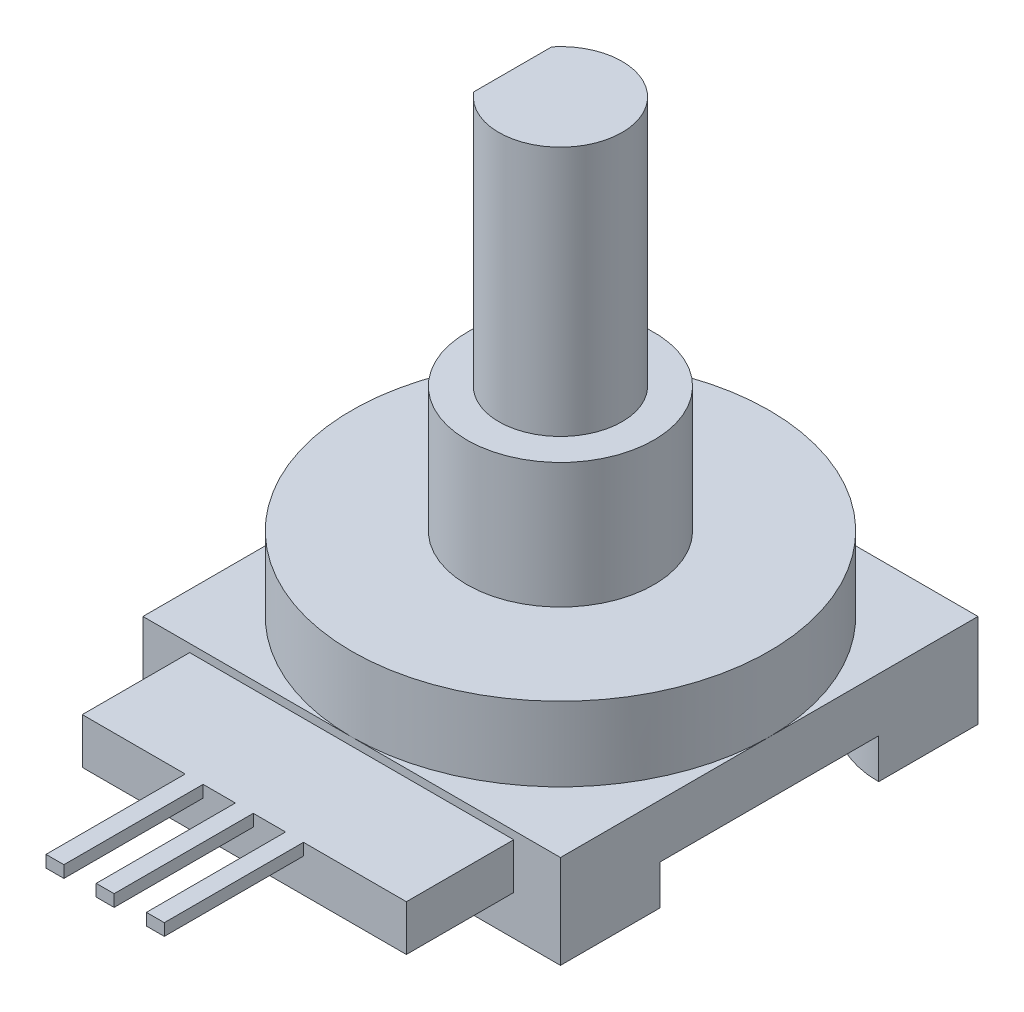
ISO-10303-21;
HEADER;
FILE_DESCRIPTION(('STEP AP214'),'2;1');
FILE_NAME('part.step','',(''),(''),'','','');
FILE_SCHEMA(('AUTOMOTIVE_DESIGN { 1 0 10303 214 1 1 1 1 }'));
ENDSEC;
DATA;
#1=APPLICATION_CONTEXT('core data for automotive mechanical design processes');
#2=APPLICATION_PROTOCOL_DEFINITION('international standard','automotive_design',2000,#1);
#3=PRODUCT_CONTEXT('',#1,'mechanical');
#4=PRODUCT('Part','Part','',(#3));
#5=PRODUCT_RELATED_PRODUCT_CATEGORY('part','',(#4));
#6=PRODUCT_DEFINITION_FORMATION('','',#4);
#7=PRODUCT_DEFINITION_CONTEXT('part definition',#1,'design');
#8=PRODUCT_DEFINITION('design','',#6,#7);
#9=PRODUCT_DEFINITION_SHAPE('','',#8);
#10=(LENGTH_UNIT() NAMED_UNIT(*) SI_UNIT(.MILLI.,.METRE.));
#11=(NAMED_UNIT(*) PLANE_ANGLE_UNIT() SI_UNIT($,.RADIAN.));
#12=(NAMED_UNIT(*) SI_UNIT($,.STERADIAN.) SOLID_ANGLE_UNIT());
#13=UNCERTAINTY_MEASURE_WITH_UNIT(LENGTH_MEASURE(1.E-05),#10,'distance_accuracy_value','');
#14=(GEOMETRIC_REPRESENTATION_CONTEXT(3) GLOBAL_UNCERTAINTY_ASSIGNED_CONTEXT((#13)) GLOBAL_UNIT_ASSIGNED_CONTEXT((#10,
#11,#12)) REPRESENTATION_CONTEXT('',''));
#15=CARTESIAN_POINT('',(0.,0.,0.));
#16=DIRECTION('',(0.,0.,1.));
#17=DIRECTION('',(1.,0.,0.));
#18=AXIS2_PLACEMENT_3D('',#15,#16,#17);
#19=CARTESIAN_POINT('',(7.525,3.7,12.4));
#20=DIRECTION('',(0.,1.,0.));
#21=DIRECTION('',(0.,0.,1.));
#22=AXIS2_PLACEMENT_3D('',#19,#20,#21);
#23=PLANE('',#22);
#24=DIRECTION('',(1.,0.,0.));
#25=VECTOR('',#24,1.);
#26=CARTESIAN_POINT('',(7.525,3.7,5.4));
#27=LINE('',#26,#25);
#28=CARTESIAN_POINT('',(7.525,3.7,5.4));
#29=VERTEX_POINT('',#28);
#30=CARTESIAN_POINT('',(8.425,3.7,5.4));
#31=VERTEX_POINT('',#30);
#32=EDGE_CURVE('E321',#29,#31,#27,.T.);
#33=ORIENTED_EDGE('',*,*,#32,.T.);
#34=DIRECTION('',(0.,0.,1.));
#35=VECTOR('',#34,1.);
#36=CARTESIAN_POINT('',(8.425,3.7,12.4));
#37=LINE('',#36,#35);
#38=CARTESIAN_POINT('',(8.425,3.7,12.4));
#39=VERTEX_POINT('',#38);
#40=EDGE_CURVE('E288',#31,#39,#37,.T.);
#41=ORIENTED_EDGE('',*,*,#40,.T.);
#42=DIRECTION('',(1.,0.,0.));
#43=VECTOR('',#42,1.);
#44=CARTESIAN_POINT('',(7.525,3.7,12.4));
#45=LINE('',#44,#43);
#46=CARTESIAN_POINT('',(7.525,3.7,12.4));
#47=VERTEX_POINT('',#46);
#48=EDGE_CURVE('E306',#47,#39,#45,.T.);
#49=ORIENTED_EDGE('',*,*,#48,.F.);
#50=DIRECTION('',(0.,0.,-1.));
#51=VECTOR('',#50,1.);
#52=CARTESIAN_POINT('',(7.525,3.7,12.4));
#53=LINE('',#52,#51);
#54=EDGE_CURVE('E335',#47,#29,#53,.T.);
#55=ORIENTED_EDGE('',*,*,#54,.T.);
#56=EDGE_LOOP('',(#33,#41,#49,#55));
#57=FACE_BOUND('',#56,.T.);
#58=ADVANCED_FACE('F32',(#57),#23,.F.);
#59=CARTESIAN_POINT('',(10.05,3.7,12.4));
#60=VERTEX_POINT('',#59);
#61=CARTESIAN_POINT('',(10.95,3.7,12.4));
#62=VERTEX_POINT('',#61);
#63=EDGE_CURVE('E310',#60,#62,#45,.T.);
#64=ORIENTED_EDGE('',*,*,#63,.F.);
#65=DIRECTION('',(0.,0.,-1.));
#66=VECTOR('',#65,1.);
#67=CARTESIAN_POINT('',(10.05,3.7,12.4));
#68=LINE('',#67,#66);
#69=CARTESIAN_POINT('',(10.05,3.7,5.4));
#70=VERTEX_POINT('',#69);
#71=EDGE_CURVE('E282',#60,#70,#68,.T.);
#72=ORIENTED_EDGE('',*,*,#71,.T.);
#73=CARTESIAN_POINT('',(10.95,3.7,5.4));
#74=VERTEX_POINT('',#73);
#75=EDGE_CURVE('E324',#70,#74,#27,.T.);
#76=ORIENTED_EDGE('',*,*,#75,.T.);
#77=DIRECTION('',(0.,0.,1.));
#78=VECTOR('',#77,1.);
#79=CARTESIAN_POINT('',(10.95,3.7,12.4));
#80=LINE('',#79,#78);
#81=EDGE_CURVE('E276',#74,#62,#80,.T.);
#82=ORIENTED_EDGE('',*,*,#81,.T.);
#83=EDGE_LOOP('',(#64,#72,#76,#82));
#84=FACE_BOUND('',#83,.T.);
#85=ADVANCED_FACE('F516',(#84),#23,.F.);
#86=CARTESIAN_POINT('',(0.,0.,12.4));
#87=DIRECTION('',(0.,0.,1.));
#88=DIRECTION('',(1.,0.,0.));
#89=AXIS2_PLACEMENT_3D('',#86,#87,#88);
#90=PLANE('',#89);
#91=DIRECTION('',(0.,-1.,0.));
#92=VECTOR('',#91,1.);
#93=CARTESIAN_POINT('',(8.425,0.,12.4));
#94=LINE('',#93,#92);
#95=CARTESIAN_POINT('',(8.425,4.3,12.4));
#96=VERTEX_POINT('',#95);
#97=EDGE_CURVE('E11',#96,#39,#94,.T.);
#98=ORIENTED_EDGE('',*,*,#97,.F.);
#99=DIRECTION('',(-1.,0.,0.));
#100=VECTOR('',#99,1.);
#101=CARTESIAN_POINT('',(7.525,4.3,12.4));
#102=LINE('',#101,#100);
#103=CARTESIAN_POINT('',(7.525,4.3,12.4));
#104=VERTEX_POINT('',#103);
#105=EDGE_CURVE('E312',#96,#104,#102,.T.);
#106=ORIENTED_EDGE('',*,*,#105,.T.);
#107=DIRECTION('',(0.,-1.,0.));
#108=VECTOR('',#107,1.);
#109=CARTESIAN_POINT('',(7.525,4.3,12.4));
#110=LINE('',#109,#108);
#111=EDGE_CURVE('E301',#104,#47,#110,.T.);
#112=ORIENTED_EDGE('',*,*,#111,.T.);
#113=ORIENTED_EDGE('',*,*,#48,.T.);
#114=EDGE_LOOP('',(#98,#106,#112,#113));
#115=FACE_BOUND('',#114,.T.);
#116=ADVANCED_FACE('F498',(#115),#90,.T.);
#117=DIRECTION('',(0.,1.,0.));
#118=VECTOR('',#117,1.);
#119=CARTESIAN_POINT('',(10.05,0.,12.4));
#120=LINE('',#119,#118);
#121=CARTESIAN_POINT('',(10.05,4.3,12.4));
#122=VERTEX_POINT('',#121);
#123=EDGE_CURVE('E40',#60,#122,#120,.T.);
#124=ORIENTED_EDGE('',*,*,#123,.F.);
#125=ORIENTED_EDGE('',*,*,#63,.T.);
#126=DIRECTION('',(0.,-1.,0.));
#127=VECTOR('',#126,1.);
#128=CARTESIAN_POINT('',(10.95,0.,12.4));
#129=LINE('',#128,#127);
#130=CARTESIAN_POINT('',(10.95,4.3,12.4));
#131=VERTEX_POINT('',#130);
#132=EDGE_CURVE('E481',#131,#62,#129,.T.);
#133=ORIENTED_EDGE('',*,*,#132,.F.);
#134=EDGE_CURVE('E317',#131,#122,#102,.T.);
#135=ORIENTED_EDGE('',*,*,#134,.T.);
#136=EDGE_LOOP('',(#124,#125,#133,#135));
#137=FACE_BOUND('',#136,.T.);
#138=ADVANCED_FACE('F494',(#137),#90,.T.);
#139=CARTESIAN_POINT('',(0.,4.7,0.));
#140=DIRECTION('',(0.,0.,-1.));
#141=DIRECTION('',(-1.,0.,0.));
#142=AXIS2_PLACEMENT_3D('',#139,#140,#141);
#143=PLANE('',#142);
#144=DIRECTION('',(1.,0.,0.));
#145=VECTOR('',#144,1.);
#146=CARTESIAN_POINT('',(2.35,2.,0.));
#147=LINE('',#146,#145);
#148=CARTESIAN_POINT('',(2.35,2.,0.));
#149=VERTEX_POINT('',#148);
#150=CARTESIAN_POINT('',(5.,2.,0.));
#151=VERTEX_POINT('',#150);
#152=EDGE_CURVE('E354',#149,#151,#147,.T.);
#153=ORIENTED_EDGE('',*,*,#152,.F.);
#154=DIRECTION('',(0.,-1.,0.));
#155=VECTOR('',#154,1.);
#156=CARTESIAN_POINT('',(2.35,4.3,0.));
#157=LINE('',#156,#155);
#158=CARTESIAN_POINT('',(2.35,4.3,0.));
#159=VERTEX_POINT('',#158);
#160=EDGE_CURVE('E338',#159,#149,#157,.T.);
#161=ORIENTED_EDGE('',*,*,#160,.F.);
#162=DIRECTION('',(-1.,0.,0.));
#163=VECTOR('',#162,1.);
#164=CARTESIAN_POINT('',(2.35,4.3,0.));
#165=LINE('',#164,#163);
#166=CARTESIAN_POINT('',(18.65,4.3,0.));
#167=VERTEX_POINT('',#166);
#168=EDGE_CURVE('E343',#167,#159,#165,.T.);
#169=ORIENTED_EDGE('',*,*,#168,.F.);
#170=DIRECTION('',(0.,1.,0.));
#171=VECTOR('',#170,1.);
#172=CARTESIAN_POINT('',(18.65,4.3,0.));
#173=LINE('',#172,#171);
#174=CARTESIAN_POINT('',(18.65,2.,0.));
#175=VERTEX_POINT('',#174);
#176=EDGE_CURVE('E356',#175,#167,#173,.T.);
#177=ORIENTED_EDGE('',*,*,#176,.F.);
#178=CARTESIAN_POINT('',(16.,2.,0.));
#179=VERTEX_POINT('',#178);
#180=EDGE_CURVE('E353',#179,#175,#147,.T.);
#181=ORIENTED_EDGE('',*,*,#180,.F.);
#182=DIRECTION('',(0.,-1.,0.));
#183=VECTOR('',#182,1.);
#184=CARTESIAN_POINT('',(16.,2.,0.));
#185=LINE('',#184,#183);
#186=CARTESIAN_POINT('',(16.,0.,0.));
#187=VERTEX_POINT('',#186);
#188=EDGE_CURVE('E392',#179,#187,#185,.T.);
#189=ORIENTED_EDGE('',*,*,#188,.T.);
#190=DIRECTION('',(1.,0.,0.));
#191=VECTOR('',#190,1.);
#192=CARTESIAN_POINT('',(0.,0.,0.));
#193=LINE('',#192,#191);
#194=CARTESIAN_POINT('',(21.,0.,0.));
#195=VERTEX_POINT('',#194);
#196=EDGE_CURVE('E457',#187,#195,#193,.T.);
#197=ORIENTED_EDGE('',*,*,#196,.T.);
#198=DIRECTION('',(0.,-1.,0.));
#199=VECTOR('',#198,1.);
#200=CARTESIAN_POINT('',(21.,4.7,0.));
#201=LINE('',#200,#199);
#202=CARTESIAN_POINT('',(21.,4.7,0.));
#203=VERTEX_POINT('',#202);
#204=EDGE_CURVE('E474',#203,#195,#201,.T.);
#205=ORIENTED_EDGE('',*,*,#204,.F.);
#206=DIRECTION('',(1.,0.,0.));
#207=VECTOR('',#206,1.);
#208=CARTESIAN_POINT('',(0.,4.7,0.));
#209=LINE('',#208,#207);
#210=CARTESIAN_POINT('',(10.5,4.7,0.));
#211=VERTEX_POINT('',#210);
#212=EDGE_CURVE('E441',#211,#203,#209,.T.);
#213=ORIENTED_EDGE('',*,*,#212,.F.);
#214=CARTESIAN_POINT('',(0.,4.7,0.));
#215=VERTEX_POINT('',#214);
#216=EDGE_CURVE('E443',#215,#211,#209,.T.);
#217=ORIENTED_EDGE('',*,*,#216,.F.);
#218=DIRECTION('',(0.,-1.,0.));
#219=VECTOR('',#218,1.);
#220=CARTESIAN_POINT('',(0.,4.7,0.));
#221=LINE('',#220,#219);
#222=CARTESIAN_POINT('',(0.,0.,0.));
#223=VERTEX_POINT('',#222);
#224=EDGE_CURVE('E477',#215,#223,#221,.T.);
#225=ORIENTED_EDGE('',*,*,#224,.T.);
#226=CARTESIAN_POINT('',(5.,0.,0.));
#227=VERTEX_POINT('',#226);
#228=EDGE_CURVE('E458',#223,#227,#193,.T.);
#229=ORIENTED_EDGE('',*,*,#228,.T.);
#230=DIRECTION('',(0.,-1.,0.));
#231=VECTOR('',#230,1.);
#232=CARTESIAN_POINT('',(5.,2.,0.));
#233=LINE('',#232,#231);
#234=EDGE_CURVE('E414',#151,#227,#233,.T.);
#235=ORIENTED_EDGE('',*,*,#234,.F.);
#236=EDGE_LOOP('',(#153,#161,#169,#177,#181,#189,#197,#205,#213,#217,#225,#229,#235));
#237=FACE_BOUND('',#236,.T.);
#238=ADVANCED_FACE('F539',(#237),#143,.F.);
#239=CARTESIAN_POINT('',(0.,0.,0.));
#240=DIRECTION('',(0.,-1.,0.));
#241=DIRECTION('',(0.,0.,-1.));
#242=AXIS2_PLACEMENT_3D('',#239,#240,#241);
#243=PLANE('',#242);
#244=CARTESIAN_POINT('',(21.,0.,0.));
#245=DIRECTION('',(0.,1.,0.));
#246=DIRECTION('',(0.,0.,1.));
#247=AXIS2_PLACEMENT_3D('',#244,#245,#246);
#248=CIRCLE('',#247,5.);
#249=CARTESIAN_POINT('',(21.,0.,-4.99999999999999));
#250=VERTEX_POINT('',#249);
#251=EDGE_CURVE('E369',#250,#187,#248,.T.);
#252=ORIENTED_EDGE('',*,*,#251,.F.);
#253=DIRECTION('',(0.,0.,-1.));
#254=VECTOR('',#253,1.);
#255=CARTESIAN_POINT('',(21.,0.,0.));
#256=LINE('',#255,#254);
#257=EDGE_CURVE('E462',#195,#250,#256,.T.);
#258=ORIENTED_EDGE('',*,*,#257,.F.);
#259=ORIENTED_EDGE('',*,*,#196,.F.);
#260=EDGE_LOOP('',(#252,#258,#259));
#261=FACE_BOUND('',#260,.T.);
#262=ADVANCED_FACE('F677',(#261),#243,.T.);
#263=CARTESIAN_POINT('',(21.,0.,-21.));
#264=DIRECTION('',(0.,1.,0.));
#265=DIRECTION('',(0.,0.,-1.));
#266=AXIS2_PLACEMENT_3D('',#263,#264,#265);
#267=CIRCLE('',#266,5.);
#268=CARTESIAN_POINT('',(16.,0.,-21.));
#269=VERTEX_POINT('',#268);
#270=CARTESIAN_POINT('',(21.,0.,-16.));
#271=VERTEX_POINT('',#270);
#272=EDGE_CURVE('E374',#269,#271,#267,.T.);
#273=ORIENTED_EDGE('',*,*,#272,.F.);
#274=DIRECTION('',(-1.,0.,0.));
#275=VECTOR('',#274,1.);
#276=CARTESIAN_POINT('',(0.,0.,-21.));
#277=LINE('',#276,#275);
#278=CARTESIAN_POINT('',(21.,0.,-21.));
#279=VERTEX_POINT('',#278);
#280=EDGE_CURVE('E466',#279,#269,#277,.T.);
#281=ORIENTED_EDGE('',*,*,#280,.F.);
#282=EDGE_CURVE('E461',#271,#279,#256,.T.);
#283=ORIENTED_EDGE('',*,*,#282,.F.);
#284=EDGE_LOOP('',(#273,#281,#283));
#285=FACE_BOUND('',#284,.T.);
#286=ADVANCED_FACE('F748',(#285),#243,.T.);
#287=CARTESIAN_POINT('',(0.,0.,-21.));
#288=DIRECTION('',(0.,1.,0.));
#289=DIRECTION('',(0.,0.,1.));
#290=AXIS2_PLACEMENT_3D('',#287,#288,#289);
#291=CIRCLE('',#290,5.);
#292=CARTESIAN_POINT('',(0.,0.,-16.));
#293=VERTEX_POINT('',#292);
#294=CARTESIAN_POINT('',(5.,0.,-21.));
#295=VERTEX_POINT('',#294);
#296=EDGE_CURVE('E396',#293,#295,#291,.T.);
#297=ORIENTED_EDGE('',*,*,#296,.F.);
#298=DIRECTION('',(0.,0.,1.));
#299=VECTOR('',#298,1.);
#300=CARTESIAN_POINT('',(0.,0.,0.));
#301=LINE('',#300,#299);
#302=CARTESIAN_POINT('',(0.,0.,-21.));
#303=VERTEX_POINT('',#302);
#304=EDGE_CURVE('E454',#303,#293,#301,.T.);
#305=ORIENTED_EDGE('',*,*,#304,.F.);
#306=EDGE_CURVE('E465',#295,#303,#277,.T.);
#307=ORIENTED_EDGE('',*,*,#306,.F.);
#308=EDGE_LOOP('',(#297,#305,#307));
#309=FACE_BOUND('',#308,.T.);
#310=ADVANCED_FACE('F705',(#309),#243,.T.);
#311=CARTESIAN_POINT('',(0.,4.7,0.));
#312=DIRECTION('',(0.,-1.,0.));
#313=DIRECTION('',(0.,0.,-1.));
#314=AXIS2_PLACEMENT_3D('',#311,#312,#313);
#315=PLANE('',#314);
#316=CARTESIAN_POINT('',(10.5,4.7,-10.5));
#317=DIRECTION('',(0.,1.,0.));
#318=DIRECTION('',(0.,0.,1.));
#319=AXIS2_PLACEMENT_3D('',#316,#317,#318);
#320=CIRCLE('',#319,10.5);
#321=CARTESIAN_POINT('',(21.,4.7,-10.5));
#322=VERTEX_POINT('',#321);
#323=EDGE_CURVE('E427',#211,#322,#320,.T.);
#324=ORIENTED_EDGE('',*,*,#323,.F.);
#325=ORIENTED_EDGE('',*,*,#212,.T.);
#326=DIRECTION('',(0.,0.,-1.));
#327=VECTOR('',#326,1.);
#328=CARTESIAN_POINT('',(21.,4.7,0.));
#329=LINE('',#328,#327);
#330=EDGE_CURVE('E446',#203,#322,#329,.T.);
#331=ORIENTED_EDGE('',*,*,#330,.T.);
#332=EDGE_LOOP('',(#324,#325,#331));
#333=FACE_BOUND('',#332,.T.);
#334=ADVANCED_FACE('F747',(#333),#315,.F.);
#335=CARTESIAN_POINT('',(10.5,4.7,-21.));
#336=VERTEX_POINT('',#335);
#337=EDGE_CURVE('E430',#322,#336,#320,.T.);
#338=ORIENTED_EDGE('',*,*,#337,.F.);
#339=CARTESIAN_POINT('',(21.,4.7,-21.));
#340=VERTEX_POINT('',#339);
#341=EDGE_CURVE('E445',#322,#340,#329,.T.);
#342=ORIENTED_EDGE('',*,*,#341,.T.);
#343=DIRECTION('',(-1.,0.,0.));
#344=VECTOR('',#343,1.);
#345=CARTESIAN_POINT('',(0.,4.7,-21.));
#346=LINE('',#345,#344);
#347=EDGE_CURVE('E450',#340,#336,#346,.T.);
#348=ORIENTED_EDGE('',*,*,#347,.T.);
#349=EDGE_LOOP('',(#338,#342,#348));
#350=FACE_BOUND('',#349,.T.);
#351=ADVANCED_FACE('F819',(#350),#315,.F.);
#352=CARTESIAN_POINT('',(0.,4.7,-10.5));
#353=VERTEX_POINT('',#352);
#354=EDGE_CURVE('E924',#336,#353,#320,.T.);
#355=ORIENTED_EDGE('',*,*,#354,.F.);
#356=CARTESIAN_POINT('',(0.,4.7,-21.));
#357=VERTEX_POINT('',#356);
#358=EDGE_CURVE('E449',#336,#357,#346,.T.);
#359=ORIENTED_EDGE('',*,*,#358,.T.);
#360=DIRECTION('',(0.,0.,1.));
#361=VECTOR('',#360,1.);
#362=CARTESIAN_POINT('',(0.,4.7,0.));
#363=LINE('',#362,#361);
#364=EDGE_CURVE('E438',#357,#353,#363,.T.);
#365=ORIENTED_EDGE('',*,*,#364,.T.);
#366=EDGE_LOOP('',(#355,#359,#365));
#367=FACE_BOUND('',#366,.T.);
#368=ADVANCED_FACE('F737',(#367),#315,.F.);
#369=CARTESIAN_POINT('',(0.,4.7,0.));
#370=DIRECTION('',(1.,0.,0.));
#371=DIRECTION('',(0.,0.,-1.));
#372=AXIS2_PLACEMENT_3D('',#369,#370,#371);
#373=PLANE('',#372);
#374=ORIENTED_EDGE('',*,*,#304,.T.);
#375=DIRECTION('',(0.,-1.,0.));
#376=VECTOR('',#375,1.);
#377=CARTESIAN_POINT('',(0.,2.,-16.));
#378=LINE('',#377,#376);
#379=CARTESIAN_POINT('',(0.,2.,-16.));
#380=VERTEX_POINT('',#379);
#381=EDGE_CURVE('E409',#380,#293,#378,.T.);
#382=ORIENTED_EDGE('',*,*,#381,.F.);
#383=DIRECTION('',(0.,0.,-1.));
#384=VECTOR('',#383,1.);
#385=CARTESIAN_POINT('',(0.,2.,-5.));
#386=LINE('',#385,#384);
#387=CARTESIAN_POINT('',(0.,2.,-5.));
#388=VERTEX_POINT('',#387);
#389=EDGE_CURVE('E377',#388,#380,#386,.T.);
#390=ORIENTED_EDGE('',*,*,#389,.F.);
#391=DIRECTION('',(0.,-1.,0.));
#392=VECTOR('',#391,1.);
#393=CARTESIAN_POINT('',(0.,2.,-5.));
#394=LINE('',#393,#392);
#395=CARTESIAN_POINT('',(0.,0.,-5.));
#396=VERTEX_POINT('',#395);
#397=EDGE_CURVE('E411',#388,#396,#394,.T.);
#398=ORIENTED_EDGE('',*,*,#397,.T.);
#399=EDGE_CURVE('E434',#396,#223,#301,.T.);
#400=ORIENTED_EDGE('',*,*,#399,.T.);
#401=ORIENTED_EDGE('',*,*,#224,.F.);
#402=EDGE_CURVE('E442',#353,#215,#363,.T.);
#403=ORIENTED_EDGE('',*,*,#402,.F.);
#404=ORIENTED_EDGE('',*,*,#364,.F.);
#405=DIRECTION('',(0.,-1.,0.));
#406=VECTOR('',#405,1.);
#407=CARTESIAN_POINT('',(0.,4.7,-21.));
#408=LINE('',#407,#406);
#409=EDGE_CURVE('E453',#357,#303,#408,.T.);
#410=ORIENTED_EDGE('',*,*,#409,.T.);
#411=EDGE_LOOP('',(#374,#382,#390,#398,#400,#401,#403,#404,#410));
#412=FACE_BOUND('',#411,.T.);
#413=ADVANCED_FACE('F34',(#412),#373,.F.);
#414=CARTESIAN_POINT('',(21.,4.7,0.));
#415=DIRECTION('',(-1.,0.,0.));
#416=DIRECTION('',(0.,0.,1.));
#417=AXIS2_PLACEMENT_3D('',#414,#415,#416);
#418=PLANE('',#417);
#419=ORIENTED_EDGE('',*,*,#257,.T.);
#420=DIRECTION('',(0.,-1.,0.));
#421=VECTOR('',#420,1.);
#422=CARTESIAN_POINT('',(21.,2.,-4.99999999999999));
#423=LINE('',#422,#421);
#424=CARTESIAN_POINT('',(21.,2.,-4.99999999999999));
#425=VERTEX_POINT('',#424);
#426=EDGE_CURVE('E399',#425,#250,#423,.T.);
#427=ORIENTED_EDGE('',*,*,#426,.F.);
#428=DIRECTION('',(0.,0.,1.));
#429=VECTOR('',#428,1.);
#430=CARTESIAN_POINT('',(21.,2.,-4.99999999999999));
#431=LINE('',#430,#429);
#432=CARTESIAN_POINT('',(21.,2.,-16.));
#433=VERTEX_POINT('',#432);
#434=EDGE_CURVE('E389',#433,#425,#431,.T.);
#435=ORIENTED_EDGE('',*,*,#434,.F.);
#436=DIRECTION('',(0.,-1.,0.));
#437=VECTOR('',#436,1.);
#438=CARTESIAN_POINT('',(21.,2.,-16.));
#439=LINE('',#438,#437);
#440=EDGE_CURVE('E401',#433,#271,#439,.T.);
#441=ORIENTED_EDGE('',*,*,#440,.T.);
#442=ORIENTED_EDGE('',*,*,#282,.T.);
#443=DIRECTION('',(0.,-1.,0.));
#444=VECTOR('',#443,1.);
#445=CARTESIAN_POINT('',(21.,4.7,-21.));
#446=LINE('',#445,#444);
#447=EDGE_CURVE('E471',#340,#279,#446,.T.);
#448=ORIENTED_EDGE('',*,*,#447,.F.);
#449=ORIENTED_EDGE('',*,*,#341,.F.);
#450=ORIENTED_EDGE('',*,*,#330,.F.);
#451=ORIENTED_EDGE('',*,*,#204,.T.);
#452=EDGE_LOOP('',(#419,#427,#435,#441,#442,#448,#449,#450,#451));
#453=FACE_BOUND('',#452,.T.);
#454=ADVANCED_FACE('F718',(#453),#418,.F.);
#455=CARTESIAN_POINT('',(0.,4.7,-21.));
#456=DIRECTION('',(0.,0.,1.));
#457=DIRECTION('',(1.,0.,0.));
#458=AXIS2_PLACEMENT_3D('',#455,#456,#457);
#459=PLANE('',#458);
#460=ORIENTED_EDGE('',*,*,#280,.T.);
#461=DIRECTION('',(0.,-1.,0.));
#462=VECTOR('',#461,1.);
#463=CARTESIAN_POINT('',(16.,2.,-21.));
#464=LINE('',#463,#462);
#465=CARTESIAN_POINT('',(16.,2.,-21.));
#466=VERTEX_POINT('',#465);
#467=EDGE_CURVE('E404',#466,#269,#464,.T.);
#468=ORIENTED_EDGE('',*,*,#467,.F.);
#469=DIRECTION('',(1.,0.,0.));
#470=VECTOR('',#469,1.);
#471=CARTESIAN_POINT('',(5.,2.,-21.));
#472=LINE('',#471,#470);
#473=CARTESIAN_POINT('',(5.,2.,-21.));
#474=VERTEX_POINT('',#473);
#475=EDGE_CURVE('E383',#474,#466,#472,.T.);
#476=ORIENTED_EDGE('',*,*,#475,.F.);
#477=DIRECTION('',(0.,-1.,0.));
#478=VECTOR('',#477,1.);
#479=CARTESIAN_POINT('',(5.,2.,-21.));
#480=LINE('',#479,#478);
#481=EDGE_CURVE('E406',#474,#295,#480,.T.);
#482=ORIENTED_EDGE('',*,*,#481,.T.);
#483=ORIENTED_EDGE('',*,*,#306,.T.);
#484=ORIENTED_EDGE('',*,*,#409,.F.);
#485=ORIENTED_EDGE('',*,*,#358,.F.);
#486=ORIENTED_EDGE('',*,*,#347,.F.);
#487=ORIENTED_EDGE('',*,*,#447,.T.);
#488=EDGE_LOOP('',(#460,#468,#476,#482,#483,#484,#485,#486,#487));
#489=FACE_BOUND('',#488,.T.);
#490=ADVANCED_FACE('F713',(#489),#459,.F.);
#491=EDGE_CURVE('E437',#353,#211,#320,.T.);
#492=ORIENTED_EDGE('',*,*,#491,.F.);
#493=ORIENTED_EDGE('',*,*,#402,.T.);
#494=ORIENTED_EDGE('',*,*,#216,.T.);
#495=EDGE_LOOP('',(#492,#493,#494));
#496=FACE_BOUND('',#495,.T.);
#497=ADVANCED_FACE('F702',(#496),#315,.F.);
#498=CARTESIAN_POINT('',(0.,0.,0.));
#499=DIRECTION('',(0.,1.,0.));
#500=DIRECTION('',(0.,0.,-1.));
#501=AXIS2_PLACEMENT_3D('',#498,#499,#500);
#502=CIRCLE('',#501,5.);
#503=EDGE_CURVE('E394',#227,#396,#502,.T.);
#504=ORIENTED_EDGE('',*,*,#503,.F.);
#505=ORIENTED_EDGE('',*,*,#228,.F.);
#506=ORIENTED_EDGE('',*,*,#399,.F.);
#507=EDGE_LOOP('',(#504,#505,#506));
#508=FACE_BOUND('',#507,.T.);
#509=ADVANCED_FACE('F696',(#508),#243,.T.);
#510=CARTESIAN_POINT('',(10.5,8.43,-10.5));
#511=DIRECTION('',(0.,-1.,0.));
#512=DIRECTION('',(0.,0.,-1.));
#513=AXIS2_PLACEMENT_3D('',#510,#511,#512);
#514=CYLINDRICAL_SURFACE('',#513,10.5);
#515=CARTESIAN_POINT('',(10.5,8.43,-10.5));
#516=DIRECTION('',(0.,1.,0.));
#517=DIRECTION('',(0.,0.,1.));
#518=AXIS2_PLACEMENT_3D('',#515,#516,#517);
#519=CIRCLE('',#518,10.5);
#520=CARTESIAN_POINT('',(10.5,8.43,0.));
#521=VERTEX_POINT('',#520);
#522=EDGE_CURVE('E431',#521,#521,#519,.T.);
#523=ORIENTED_EDGE('',*,*,#522,.F.);
#524=EDGE_LOOP('',(#523));
#525=FACE_BOUND('',#524,.T.);
#526=ORIENTED_EDGE('',*,*,#323,.T.);
#527=ORIENTED_EDGE('',*,*,#337,.T.);
#528=ORIENTED_EDGE('',*,*,#354,.T.);
#529=ORIENTED_EDGE('',*,*,#491,.T.);
#530=EDGE_LOOP('',(#526,#527,#528,#529));
#531=FACE_BOUND('',#530,.T.);
#532=ADVANCED_FACE('F701',(#525,#531),#514,.T.);
#533=CARTESIAN_POINT('',(10.5,8.43,-10.5));
#534=DIRECTION('',(0.,1.,0.));
#535=DIRECTION('',(0.,0.,1.));
#536=AXIS2_PLACEMENT_3D('',#533,#534,#535);
#537=PLANE('',#536);
#538=CARTESIAN_POINT('',(10.5,8.43,-10.5));
#539=DIRECTION('',(0.,1.,0.));
#540=DIRECTION('',(0.,0.,1.));
#541=AXIS2_PLACEMENT_3D('',#538,#539,#540);
#542=CIRCLE('',#541,4.7);
#543=CARTESIAN_POINT('',(10.5,8.43,-5.8));
#544=VERTEX_POINT('',#543);
#545=EDGE_CURVE('E424',#544,#544,#542,.T.);
#546=ORIENTED_EDGE('',*,*,#545,.F.);
#547=EDGE_LOOP('',(#546));
#548=FACE_BOUND('',#547,.T.);
#549=ORIENTED_EDGE('',*,*,#522,.T.);
#550=EDGE_LOOP('',(#549));
#551=FACE_BOUND('',#550,.T.);
#552=ADVANCED_FACE('F786',(#548,#551),#537,.T.);
#553=CARTESIAN_POINT('',(10.5,14.73,-10.5));
#554=DIRECTION('',(0.,-1.,0.));
#555=DIRECTION('',(0.,0.,-1.));
#556=AXIS2_PLACEMENT_3D('',#553,#554,#555);
#557=CYLINDRICAL_SURFACE('',#556,4.7);
#558=CARTESIAN_POINT('',(10.5,14.73,-10.5));
#559=DIRECTION('',(0.,1.,0.));
#560=DIRECTION('',(0.,0.,1.));
#561=AXIS2_PLACEMENT_3D('',#558,#559,#560);
#562=CIRCLE('',#561,4.7);
#563=CARTESIAN_POINT('',(10.5,14.73,-5.8));
#564=VERTEX_POINT('',#563);
#565=EDGE_CURVE('E419',#564,#564,#562,.T.);
#566=ORIENTED_EDGE('',*,*,#565,.F.);
#567=EDGE_LOOP('',(#566));
#568=FACE_BOUND('',#567,.T.);
#569=ORIENTED_EDGE('',*,*,#545,.T.);
#570=EDGE_LOOP('',(#569));
#571=FACE_BOUND('',#570,.T.);
#572=ADVANCED_FACE('F774',(#568,#571),#557,.T.);
#573=CARTESIAN_POINT('',(10.5,14.73,-10.5));
#574=DIRECTION('',(0.,1.,0.));
#575=DIRECTION('',(0.,0.,1.));
#576=AXIS2_PLACEMENT_3D('',#573,#574,#575);
#577=PLANE('',#576);
#578=CARTESIAN_POINT('',(10.5,14.73,-10.5));
#579=DIRECTION('',(0.,1.,0.));
#580=DIRECTION('',(0.,0.,1.));
#581=AXIS2_PLACEMENT_3D('',#578,#579,#580);
#582=CIRCLE('',#581,3.1);
#583=CARTESIAN_POINT('',(10.5,14.73,-7.4));
#584=VERTEX_POINT('',#583);
#585=EDGE_CURVE('E420',#584,#584,#582,.T.);
#586=ORIENTED_EDGE('',*,*,#585,.F.);
#587=EDGE_LOOP('',(#586));
#588=FACE_BOUND('',#587,.T.);
#589=ORIENTED_EDGE('',*,*,#565,.T.);
#590=EDGE_LOOP('',(#589));
#591=FACE_BOUND('',#590,.T.);
#592=ADVANCED_FACE('F769',(#588,#591),#577,.T.);
#593=CARTESIAN_POINT('',(10.5,27.33,-10.5));
#594=DIRECTION('',(0.,-1.,0.));
#595=DIRECTION('',(0.,0.,-1.));
#596=AXIS2_PLACEMENT_3D('',#593,#594,#595);
#597=CYLINDRICAL_SURFACE('',#596,3.1);
#598=CARTESIAN_POINT('',(10.5,27.33,-10.5));
#599=DIRECTION('',(0.,1.,0.));
#600=DIRECTION('',(0.,0.,1.));
#601=AXIS2_PLACEMENT_3D('',#598,#599,#600);
#602=CIRCLE('',#601,3.1);
#603=CARTESIAN_POINT('',(8.1,27.33,-8.53785831296514));
#604=VERTEX_POINT('',#603);
#605=CARTESIAN_POINT('',(8.1,27.33,-12.4621416870349));
#606=VERTEX_POINT('',#605);
#607=EDGE_CURVE('E255',#604,#606,#602,.T.);
#608=ORIENTED_EDGE('',*,*,#607,.F.);
#609=DIRECTION('',(0.,1.,0.));
#610=VECTOR('',#609,1.);
#611=CARTESIAN_POINT('',(8.1,17.69,-8.53785831296514));
#612=LINE('',#611,#610);
#613=CARTESIAN_POINT('',(8.1,17.69,-8.53785831296514));
#614=VERTEX_POINT('',#613);
#615=EDGE_CURVE('E47',#614,#604,#612,.T.);
#616=ORIENTED_EDGE('',*,*,#615,.F.);
#617=CARTESIAN_POINT('',(10.5,17.69,-10.5));
#618=DIRECTION('',(0.,1.,0.));
#619=DIRECTION('',(0.,0.,1.));
#620=AXIS2_PLACEMENT_3D('',#617,#618,#619);
#621=CIRCLE('',#620,3.1);
#622=CARTESIAN_POINT('',(8.1,17.69,-12.4621416870349));
#623=VERTEX_POINT('',#622);
#624=EDGE_CURVE('E241',#623,#614,#621,.T.);
#625=ORIENTED_EDGE('',*,*,#624,.F.);
#626=DIRECTION('',(0.,1.,0.));
#627=VECTOR('',#626,1.);
#628=CARTESIAN_POINT('',(8.1,17.69,-12.4621416870349));
#629=LINE('',#628,#627);
#630=EDGE_CURVE('E249',#623,#606,#629,.T.);
#631=ORIENTED_EDGE('',*,*,#630,.T.);
#632=EDGE_LOOP('',(#608,#616,#625,#631));
#633=FACE_BOUND('',#632,.T.);
#634=ORIENTED_EDGE('',*,*,#585,.T.);
#635=EDGE_LOOP('',(#634));
#636=FACE_BOUND('',#635,.T.);
#637=ADVANCED_FACE('F252',(#633,#636),#597,.T.);
#638=CARTESIAN_POINT('',(10.5,27.33,-10.5));
#639=DIRECTION('',(0.,1.,0.));
#640=DIRECTION('',(0.,0.,1.));
#641=AXIS2_PLACEMENT_3D('',#638,#639,#640);
#642=PLANE('',#641);
#643=DIRECTION('',(0.,0.,-1.));
#644=VECTOR('',#643,1.);
#645=CARTESIAN_POINT('',(8.1,27.33,-12.4621416870349));
#646=LINE('',#645,#644);
#647=EDGE_CURVE('E246',#604,#606,#646,.T.);
#648=ORIENTED_EDGE('',*,*,#647,.F.);
#649=ORIENTED_EDGE('',*,*,#607,.T.);
#650=EDGE_LOOP('',(#648,#649));
#651=FACE_BOUND('',#650,.T.);
#652=ADVANCED_FACE('F665',(#651),#642,.T.);
#653=CARTESIAN_POINT('',(21.,2.,0.));
#654=DIRECTION('',(0.,-1.,0.));
#655=DIRECTION('',(0.,0.,-1.));
#656=AXIS2_PLACEMENT_3D('',#653,#654,#655);
#657=CYLINDRICAL_SURFACE('',#656,5.);
#658=ORIENTED_EDGE('',*,*,#251,.T.);
#659=ORIENTED_EDGE('',*,*,#188,.F.);
#660=CARTESIAN_POINT('',(21.,2.,0.));
#661=DIRECTION('',(0.,1.,0.));
#662=DIRECTION('',(0.,0.,1.));
#663=AXIS2_PLACEMENT_3D('',#660,#661,#662);
#664=CIRCLE('',#663,5.);
#665=EDGE_CURVE('E370',#425,#179,#664,.T.);
#666=ORIENTED_EDGE('',*,*,#665,.F.);
#667=ORIENTED_EDGE('',*,*,#426,.T.);
#668=EDGE_LOOP('',(#658,#659,#666,#667));
#669=FACE_BOUND('',#668,.T.);
#670=ADVANCED_FACE('F659',(#669),#657,.T.);
#671=CARTESIAN_POINT('',(21.,2.,-21.));
#672=DIRECTION('',(0.,-1.,0.));
#673=DIRECTION('',(0.,0.,-1.));
#674=AXIS2_PLACEMENT_3D('',#671,#672,#673);
#675=CYLINDRICAL_SURFACE('',#674,5.);
#676=ORIENTED_EDGE('',*,*,#272,.T.);
#677=ORIENTED_EDGE('',*,*,#440,.F.);
#678=CARTESIAN_POINT('',(21.,2.,-21.));
#679=DIRECTION('',(0.,1.,0.));
#680=DIRECTION('',(0.,0.,-1.));
#681=AXIS2_PLACEMENT_3D('',#678,#679,#680);
#682=CIRCLE('',#681,5.);
#683=EDGE_CURVE('E386',#466,#433,#682,.T.);
#684=ORIENTED_EDGE('',*,*,#683,.F.);
#685=ORIENTED_EDGE('',*,*,#467,.T.);
#686=EDGE_LOOP('',(#676,#677,#684,#685));
#687=FACE_BOUND('',#686,.T.);
#688=ADVANCED_FACE('F664',(#687),#675,.T.);
#689=CARTESIAN_POINT('',(0.,2.,-21.));
#690=DIRECTION('',(0.,-1.,0.));
#691=DIRECTION('',(0.,0.,-1.));
#692=AXIS2_PLACEMENT_3D('',#689,#690,#691);
#693=CYLINDRICAL_SURFACE('',#692,5.);
#694=ORIENTED_EDGE('',*,*,#296,.T.);
#695=ORIENTED_EDGE('',*,*,#481,.F.);
#696=CARTESIAN_POINT('',(0.,2.,-21.));
#697=DIRECTION('',(0.,1.,0.));
#698=DIRECTION('',(0.,0.,1.));
#699=AXIS2_PLACEMENT_3D('',#696,#697,#698);
#700=CIRCLE('',#699,5.);
#701=EDGE_CURVE('E380',#380,#474,#700,.T.);
#702=ORIENTED_EDGE('',*,*,#701,.F.);
#703=ORIENTED_EDGE('',*,*,#381,.T.);
#704=EDGE_LOOP('',(#694,#695,#702,#703));
#705=FACE_BOUND('',#704,.T.);
#706=ADVANCED_FACE('F651',(#705),#693,.T.);
#707=CARTESIAN_POINT('',(0.,2.,0.));
#708=DIRECTION('',(0.,-1.,0.));
#709=DIRECTION('',(0.,0.,-1.));
#710=AXIS2_PLACEMENT_3D('',#707,#708,#709);
#711=CYLINDRICAL_SURFACE('',#710,5.);
#712=ORIENTED_EDGE('',*,*,#503,.T.);
#713=ORIENTED_EDGE('',*,*,#397,.F.);
#714=CARTESIAN_POINT('',(0.,2.,0.));
#715=DIRECTION('',(0.,1.,0.));
#716=DIRECTION('',(0.,0.,-1.));
#717=AXIS2_PLACEMENT_3D('',#714,#715,#716);
#718=CIRCLE('',#717,5.);
#719=EDGE_CURVE('E373',#151,#388,#718,.T.);
#720=ORIENTED_EDGE('',*,*,#719,.F.);
#721=ORIENTED_EDGE('',*,*,#234,.T.);
#722=EDGE_LOOP('',(#712,#713,#720,#721));
#723=FACE_BOUND('',#722,.T.);
#724=ADVANCED_FACE('F591',(#723),#711,.T.);
#725=CARTESIAN_POINT('',(21.,2.,0.));
#726=DIRECTION('',(0.,1.,0.));
#727=DIRECTION('',(0.,0.,1.));
#728=AXIS2_PLACEMENT_3D('',#725,#726,#727);
#729=PLANE('',#728);
#730=ORIENTED_EDGE('',*,*,#665,.T.);
#731=ORIENTED_EDGE('',*,*,#180,.T.);
#732=DIRECTION('',(0.,0.,-1.));
#733=VECTOR('',#732,1.);
#734=CARTESIAN_POINT('',(18.65,2.,5.4));
#735=LINE('',#734,#733);
#736=CARTESIAN_POINT('',(18.65,2.,5.4));
#737=VERTEX_POINT('',#736);
#738=EDGE_CURVE('E364',#737,#175,#735,.T.);
#739=ORIENTED_EDGE('',*,*,#738,.F.);
#740=DIRECTION('',(1.,0.,0.));
#741=VECTOR('',#740,1.);
#742=CARTESIAN_POINT('',(2.35,2.,5.4));
#743=LINE('',#742,#741);
#744=CARTESIAN_POINT('',(2.35,2.,5.4));
#745=VERTEX_POINT('',#744);
#746=EDGE_CURVE('E342',#745,#737,#743,.T.);
#747=ORIENTED_EDGE('',*,*,#746,.F.);
#748=DIRECTION('',(0.,0.,-1.));
#749=VECTOR('',#748,1.);
#750=CARTESIAN_POINT('',(2.35,2.,5.4));
#751=LINE('',#750,#749);
#752=EDGE_CURVE('E367',#745,#149,#751,.T.);
#753=ORIENTED_EDGE('',*,*,#752,.T.);
#754=ORIENTED_EDGE('',*,*,#152,.T.);
#755=ORIENTED_EDGE('',*,*,#719,.T.);
#756=ORIENTED_EDGE('',*,*,#389,.T.);
#757=ORIENTED_EDGE('',*,*,#701,.T.);
#758=ORIENTED_EDGE('',*,*,#475,.T.);
#759=ORIENTED_EDGE('',*,*,#683,.T.);
#760=ORIENTED_EDGE('',*,*,#434,.T.);
#761=EDGE_LOOP('',(#730,#731,#739,#747,#753,#754,#755,#756,#757,#758,#759,#760));
#762=FACE_BOUND('',#761,.T.);
#763=ADVANCED_FACE('F547',(#762),#729,.F.);
#764=CARTESIAN_POINT('',(2.35,4.3,5.4));
#765=DIRECTION('',(1.,0.,0.));
#766=DIRECTION('',(0.,0.,-1.));
#767=AXIS2_PLACEMENT_3D('',#764,#765,#766);
#768=PLANE('',#767);
#769=ORIENTED_EDGE('',*,*,#160,.T.);
#770=ORIENTED_EDGE('',*,*,#752,.F.);
#771=DIRECTION('',(0.,-1.,0.));
#772=VECTOR('',#771,1.);
#773=CARTESIAN_POINT('',(2.35,4.3,5.4));
#774=LINE('',#773,#772);
#775=CARTESIAN_POINT('',(2.35,4.3,5.4));
#776=VERTEX_POINT('',#775);
#777=EDGE_CURVE('E339',#776,#745,#774,.T.);
#778=ORIENTED_EDGE('',*,*,#777,.F.);
#779=DIRECTION('',(0.,0.,-1.));
#780=VECTOR('',#779,1.);
#781=CARTESIAN_POINT('',(2.35,4.3,5.4));
#782=LINE('',#781,#780);
#783=EDGE_CURVE('E350',#776,#159,#782,.T.);
#784=ORIENTED_EDGE('',*,*,#783,.T.);
#785=EDGE_LOOP('',(#769,#770,#778,#784));
#786=FACE_BOUND('',#785,.T.);
#787=ADVANCED_FACE('F543',(#786),#768,.F.);
#788=CARTESIAN_POINT('',(18.65,4.3,5.4));
#789=DIRECTION('',(-1.,0.,0.));
#790=DIRECTION('',(0.,0.,1.));
#791=AXIS2_PLACEMENT_3D('',#788,#789,#790);
#792=PLANE('',#791);
#793=ORIENTED_EDGE('',*,*,#176,.T.);
#794=DIRECTION('',(0.,0.,-1.));
#795=VECTOR('',#794,1.);
#796=CARTESIAN_POINT('',(18.65,4.3,5.4));
#797=LINE('',#796,#795);
#798=CARTESIAN_POINT('',(18.65,4.3,5.4));
#799=VERTEX_POINT('',#798);
#800=EDGE_CURVE('E361',#799,#167,#797,.T.);
#801=ORIENTED_EDGE('',*,*,#800,.F.);
#802=DIRECTION('',(0.,1.,0.));
#803=VECTOR('',#802,1.);
#804=CARTESIAN_POINT('',(18.65,4.3,5.4));
#805=LINE('',#804,#803);
#806=EDGE_CURVE('E345',#737,#799,#805,.T.);
#807=ORIENTED_EDGE('',*,*,#806,.F.);
#808=ORIENTED_EDGE('',*,*,#738,.T.);
#809=EDGE_LOOP('',(#793,#801,#807,#808));
#810=FACE_BOUND('',#809,.T.);
#811=ADVANCED_FACE('F548',(#810),#792,.F.);
#812=CARTESIAN_POINT('',(2.35,4.3,5.4));
#813=DIRECTION('',(0.,-1.,0.));
#814=DIRECTION('',(0.,0.,-1.));
#815=AXIS2_PLACEMENT_3D('',#812,#813,#814);
#816=PLANE('',#815);
#817=ORIENTED_EDGE('',*,*,#105,.F.);
#818=DIRECTION('',(0.,0.,-1.));
#819=VECTOR('',#818,1.);
#820=CARTESIAN_POINT('',(8.425,4.3,5.4));
#821=LINE('',#820,#819);
#822=CARTESIAN_POINT('',(8.425,4.3,5.4));
#823=VERTEX_POINT('',#822);
#824=EDGE_CURVE('E291',#96,#823,#821,.T.);
#825=ORIENTED_EDGE('',*,*,#824,.T.);
#826=DIRECTION('',(1.,0.,0.));
#827=VECTOR('',#826,1.);
#828=CARTESIAN_POINT('',(2.35,4.3,5.4));
#829=LINE('',#828,#827);
#830=CARTESIAN_POINT('',(10.05,4.3,5.4));
#831=VERTEX_POINT('',#830);
#832=EDGE_CURVE('E297',#823,#831,#829,.T.);
#833=ORIENTED_EDGE('',*,*,#832,.T.);
#834=DIRECTION('',(0.,0.,1.));
#835=VECTOR('',#834,1.);
#836=CARTESIAN_POINT('',(10.05,4.3,5.4));
#837=LINE('',#836,#835);
#838=EDGE_CURVE('E285',#831,#122,#837,.T.);
#839=ORIENTED_EDGE('',*,*,#838,.T.);
#840=ORIENTED_EDGE('',*,*,#134,.F.);
#841=DIRECTION('',(0.,0.,-1.));
#842=VECTOR('',#841,1.);
#843=CARTESIAN_POINT('',(10.95,4.3,5.4));
#844=LINE('',#843,#842);
#845=CARTESIAN_POINT('',(10.95,4.3,5.4));
#846=VERTEX_POINT('',#845);
#847=EDGE_CURVE('E279',#131,#846,#844,.T.);
#848=ORIENTED_EDGE('',*,*,#847,.T.);
#849=DIRECTION('',(1.,0.,0.));
#850=VECTOR('',#849,1.);
#851=CARTESIAN_POINT('',(2.35,4.3,5.4));
#852=LINE('',#851,#850);
#853=CARTESIAN_POINT('',(12.575,4.3,5.4));
#854=VERTEX_POINT('',#853);
#855=EDGE_CURVE('E294',#846,#854,#852,.T.);
#856=ORIENTED_EDGE('',*,*,#855,.T.);
#857=DIRECTION('',(0.,0.,1.));
#858=VECTOR('',#857,1.);
#859=CARTESIAN_POINT('',(12.575,4.3,5.4));
#860=LINE('',#859,#858);
#861=CARTESIAN_POINT('',(12.575,4.3,12.4));
#862=VERTEX_POINT('',#861);
#863=EDGE_CURVE('E273',#854,#862,#860,.T.);
#864=ORIENTED_EDGE('',*,*,#863,.T.);
#865=CARTESIAN_POINT('',(13.475,4.3,12.4));
#866=VERTEX_POINT('',#865);
#867=EDGE_CURVE('E313',#866,#862,#102,.T.);
#868=ORIENTED_EDGE('',*,*,#867,.F.);
#869=DIRECTION('',(0.,0.,-1.));
#870=VECTOR('',#869,1.);
#871=CARTESIAN_POINT('',(13.475,4.3,12.4));
#872=LINE('',#871,#870);
#873=CARTESIAN_POINT('',(13.475,4.3,5.4));
#874=VERTEX_POINT('',#873);
#875=EDGE_CURVE('E329',#866,#874,#872,.T.);
#876=ORIENTED_EDGE('',*,*,#875,.T.);
#877=DIRECTION('',(-1.,0.,0.));
#878=VECTOR('',#877,1.);
#879=CARTESIAN_POINT('',(2.35,4.3,5.4));
#880=LINE('',#879,#878);
#881=EDGE_CURVE('E348',#799,#874,#880,.T.);
#882=ORIENTED_EDGE('',*,*,#881,.F.);
#883=ORIENTED_EDGE('',*,*,#800,.T.);
#884=ORIENTED_EDGE('',*,*,#168,.T.);
#885=ORIENTED_EDGE('',*,*,#783,.F.);
#886=CARTESIAN_POINT('',(7.525,4.3,5.4));
#887=VERTEX_POINT('',#886);
#888=EDGE_CURVE('E347',#887,#776,#880,.T.);
#889=ORIENTED_EDGE('',*,*,#888,.F.);
#890=DIRECTION('',(0.,0.,-1.));
#891=VECTOR('',#890,1.);
#892=CARTESIAN_POINT('',(7.525,4.3,12.4));
#893=LINE('',#892,#891);
#894=EDGE_CURVE('E316',#104,#887,#893,.T.);
#895=ORIENTED_EDGE('',*,*,#894,.F.);
#896=EDGE_LOOP('',(#817,#825,#833,#839,#840,#848,#856,#864,#868,#876,#882,#883,#884,#885,#889,#895));
#897=FACE_BOUND('',#896,.T.);
#898=ADVANCED_FACE('F492',(#897),#816,.F.);
#899=CARTESIAN_POINT('',(0.,0.,5.4));
#900=DIRECTION('',(0.,0.,1.));
#901=DIRECTION('',(1.,0.,0.));
#902=AXIS2_PLACEMENT_3D('',#899,#900,#901);
#903=PLANE('',#902);
#904=CARTESIAN_POINT('',(12.575,3.7,5.4));
#905=VERTEX_POINT('',#904);
#906=CARTESIAN_POINT('',(13.475,3.7,5.4));
#907=VERTEX_POINT('',#906);
#908=EDGE_CURVE('E320',#905,#907,#27,.T.);
#909=ORIENTED_EDGE('',*,*,#908,.F.);
#910=DIRECTION('',(0.,1.,0.));
#911=VECTOR('',#910,1.);
#912=CARTESIAN_POINT('',(12.575,0.,5.4));
#913=LINE('',#912,#911);
#914=EDGE_CURVE('E257',#905,#854,#913,.T.);
#915=ORIENTED_EDGE('',*,*,#914,.T.);
#916=ORIENTED_EDGE('',*,*,#855,.F.);
#917=DIRECTION('',(0.,1.,0.));
#918=VECTOR('',#917,1.);
#919=CARTESIAN_POINT('',(10.95,0.,5.4));
#920=LINE('',#919,#918);
#921=EDGE_CURVE('E267',#74,#846,#920,.T.);
#922=ORIENTED_EDGE('',*,*,#921,.F.);
#923=ORIENTED_EDGE('',*,*,#75,.F.);
#924=DIRECTION('',(0.,1.,0.));
#925=VECTOR('',#924,1.);
#926=CARTESIAN_POINT('',(10.05,0.,5.4));
#927=LINE('',#926,#925);
#928=EDGE_CURVE('E264',#70,#831,#927,.T.);
#929=ORIENTED_EDGE('',*,*,#928,.T.);
#930=ORIENTED_EDGE('',*,*,#832,.F.);
#931=DIRECTION('',(0.,1.,0.));
#932=VECTOR('',#931,1.);
#933=CARTESIAN_POINT('',(8.425,0.,5.4));
#934=LINE('',#933,#932);
#935=EDGE_CURVE('E261',#31,#823,#934,.T.);
#936=ORIENTED_EDGE('',*,*,#935,.F.);
#937=ORIENTED_EDGE('',*,*,#32,.F.);
#938=DIRECTION('',(0.,-1.,0.));
#939=VECTOR('',#938,1.);
#940=CARTESIAN_POINT('',(7.525,4.3,5.4));
#941=LINE('',#940,#939);
#942=EDGE_CURVE('E300',#887,#29,#941,.T.);
#943=ORIENTED_EDGE('',*,*,#942,.F.);
#944=ORIENTED_EDGE('',*,*,#888,.T.);
#945=ORIENTED_EDGE('',*,*,#777,.T.);
#946=ORIENTED_EDGE('',*,*,#746,.T.);
#947=ORIENTED_EDGE('',*,*,#806,.T.);
#948=ORIENTED_EDGE('',*,*,#881,.T.);
#949=DIRECTION('',(0.,1.,0.));
#950=VECTOR('',#949,1.);
#951=CARTESIAN_POINT('',(13.475,4.3,5.4));
#952=LINE('',#951,#950);
#953=EDGE_CURVE('E305',#907,#874,#952,.T.);
#954=ORIENTED_EDGE('',*,*,#953,.F.);
#955=EDGE_LOOP('',(#909,#915,#916,#922,#923,#929,#930,#936,#937,#943,#944,#945,#946,#947,#948,#954));
#956=FACE_BOUND('',#955,.T.);
#957=ADVANCED_FACE('F511',(#956),#903,.T.);
#958=CARTESIAN_POINT('',(7.525,4.3,12.4));
#959=DIRECTION('',(1.,0.,0.));
#960=DIRECTION('',(0.,1.,0.));
#961=AXIS2_PLACEMENT_3D('',#958,#959,#960);
#962=PLANE('',#961);
#963=ORIENTED_EDGE('',*,*,#942,.T.);
#964=ORIENTED_EDGE('',*,*,#54,.F.);
#965=ORIENTED_EDGE('',*,*,#111,.F.);
#966=ORIENTED_EDGE('',*,*,#894,.T.);
#967=EDGE_LOOP('',(#963,#964,#965,#966));
#968=FACE_BOUND('',#967,.T.);
#969=ADVANCED_FACE('F504',(#968),#962,.F.);
#970=CARTESIAN_POINT('',(12.575,3.7,12.4));
#971=VERTEX_POINT('',#970);
#972=CARTESIAN_POINT('',(13.475,3.7,12.4));
#973=VERTEX_POINT('',#972);
#974=EDGE_CURVE('E304',#971,#973,#45,.T.);
#975=ORIENTED_EDGE('',*,*,#974,.F.);
#976=DIRECTION('',(0.,0.,-1.));
#977=VECTOR('',#976,1.);
#978=CARTESIAN_POINT('',(12.575,3.7,12.4));
#979=LINE('',#978,#977);
#980=EDGE_CURVE('E55',#971,#905,#979,.T.);
#981=ORIENTED_EDGE('',*,*,#980,.T.);
#982=ORIENTED_EDGE('',*,*,#908,.T.);
#983=DIRECTION('',(0.,0.,-1.));
#984=VECTOR('',#983,1.);
#985=CARTESIAN_POINT('',(13.475,3.7,12.4));
#986=LINE('',#985,#984);
#987=EDGE_CURVE('E332',#973,#907,#986,.T.);
#988=ORIENTED_EDGE('',*,*,#987,.F.);
#989=EDGE_LOOP('',(#975,#981,#982,#988));
#990=FACE_BOUND('',#989,.T.);
#991=ADVANCED_FACE('F524',(#990),#23,.F.);
#992=CARTESIAN_POINT('',(13.475,4.3,12.4));
#993=DIRECTION('',(-1.,0.,0.));
#994=DIRECTION('',(0.,-1.,0.));
#995=AXIS2_PLACEMENT_3D('',#992,#993,#994);
#996=PLANE('',#995);
#997=ORIENTED_EDGE('',*,*,#953,.T.);
#998=ORIENTED_EDGE('',*,*,#875,.F.);
#999=DIRECTION('',(0.,1.,0.));
#1000=VECTOR('',#999,1.);
#1001=CARTESIAN_POINT('',(13.475,4.3,12.4));
#1002=LINE('',#1001,#1000);
#1003=EDGE_CURVE('E309',#973,#866,#1002,.T.);
#1004=ORIENTED_EDGE('',*,*,#1003,.F.);
#1005=ORIENTED_EDGE('',*,*,#987,.T.);
#1006=EDGE_LOOP('',(#997,#998,#1004,#1005));
#1007=FACE_BOUND('',#1006,.T.);
#1008=ADVANCED_FACE('F527',(#1007),#996,.F.);
#1009=DIRECTION('',(0.,1.,0.));
#1010=VECTOR('',#1009,1.);
#1011=CARTESIAN_POINT('',(12.575,0.,12.4));
#1012=LINE('',#1011,#1010);
#1013=EDGE_CURVE('E423',#971,#862,#1012,.T.);
#1014=ORIENTED_EDGE('',*,*,#1013,.F.);
#1015=ORIENTED_EDGE('',*,*,#974,.T.);
#1016=ORIENTED_EDGE('',*,*,#1003,.T.);
#1017=ORIENTED_EDGE('',*,*,#867,.T.);
#1018=EDGE_LOOP('',(#1014,#1015,#1016,#1017));
#1019=FACE_BOUND('',#1018,.T.);
#1020=ADVANCED_FACE('F520',(#1019),#90,.T.);
#1021=CARTESIAN_POINT('',(10.95,0.,12.4));
#1022=DIRECTION('',(-1.,0.,0.));
#1023=DIRECTION('',(0.,0.,1.));
#1024=AXIS2_PLACEMENT_3D('',#1021,#1022,#1023);
#1025=PLANE('',#1024);
#1026=ORIENTED_EDGE('',*,*,#132,.T.);
#1027=ORIENTED_EDGE('',*,*,#81,.F.);
#1028=ORIENTED_EDGE('',*,*,#921,.T.);
#1029=ORIENTED_EDGE('',*,*,#847,.F.);
#1030=EDGE_LOOP('',(#1026,#1027,#1028,#1029));
#1031=FACE_BOUND('',#1030,.T.);
#1032=ADVANCED_FACE('F873',(#1031),#1025,.F.);
#1033=CARTESIAN_POINT('',(12.575,0.,12.4));
#1034=DIRECTION('',(1.,0.,0.));
#1035=DIRECTION('',(0.,0.,-1.));
#1036=AXIS2_PLACEMENT_3D('',#1033,#1034,#1035);
#1037=PLANE('',#1036);
#1038=ORIENTED_EDGE('',*,*,#914,.F.);
#1039=ORIENTED_EDGE('',*,*,#980,.F.);
#1040=ORIENTED_EDGE('',*,*,#1013,.T.);
#1041=ORIENTED_EDGE('',*,*,#863,.F.);
#1042=EDGE_LOOP('',(#1038,#1039,#1040,#1041));
#1043=FACE_BOUND('',#1042,.T.);
#1044=ADVANCED_FACE('F530',(#1043),#1037,.F.);
#1045=CARTESIAN_POINT('',(8.425,0.,12.4));
#1046=DIRECTION('',(-1.,0.,0.));
#1047=DIRECTION('',(0.,0.,1.));
#1048=AXIS2_PLACEMENT_3D('',#1045,#1046,#1047);
#1049=PLANE('',#1048);
#1050=ORIENTED_EDGE('',*,*,#97,.T.);
#1051=ORIENTED_EDGE('',*,*,#40,.F.);
#1052=ORIENTED_EDGE('',*,*,#935,.T.);
#1053=ORIENTED_EDGE('',*,*,#824,.F.);
#1054=EDGE_LOOP('',(#1050,#1051,#1052,#1053));
#1055=FACE_BOUND('',#1054,.T.);
#1056=ADVANCED_FACE('F508',(#1055),#1049,.F.);
#1057=CARTESIAN_POINT('',(10.05,0.,12.4));
#1058=DIRECTION('',(1.,0.,0.));
#1059=DIRECTION('',(0.,0.,-1.));
#1060=AXIS2_PLACEMENT_3D('',#1057,#1058,#1059);
#1061=PLANE('',#1060);
#1062=ORIENTED_EDGE('',*,*,#928,.F.);
#1063=ORIENTED_EDGE('',*,*,#71,.F.);
#1064=ORIENTED_EDGE('',*,*,#123,.T.);
#1065=ORIENTED_EDGE('',*,*,#838,.F.);
#1066=EDGE_LOOP('',(#1062,#1063,#1064,#1065));
#1067=FACE_BOUND('',#1066,.T.);
#1068=ADVANCED_FACE('F484',(#1067),#1061,.F.);
#1069=CARTESIAN_POINT('',(8.1,17.69,-12.4621416870349));
#1070=DIRECTION('',(1.,0.,0.));
#1071=DIRECTION('',(0.,0.,-1.));
#1072=AXIS2_PLACEMENT_3D('',#1069,#1070,#1071);
#1073=PLANE('',#1072);
#1074=ORIENTED_EDGE('',*,*,#647,.T.);
#1075=ORIENTED_EDGE('',*,*,#630,.F.);
#1076=DIRECTION('',(0.,0.,-1.));
#1077=VECTOR('',#1076,1.);
#1078=CARTESIAN_POINT('',(8.1,17.69,-12.4621416870349));
#1079=LINE('',#1078,#1077);
#1080=EDGE_CURVE('E243',#614,#623,#1079,.T.);
#1081=ORIENTED_EDGE('',*,*,#1080,.F.);
#1082=ORIENTED_EDGE('',*,*,#615,.T.);
#1083=EDGE_LOOP('',(#1074,#1075,#1081,#1082));
#1084=FACE_BOUND('',#1083,.T.);
#1085=ADVANCED_FACE('F248',(#1084),#1073,.F.);
#1086=CARTESIAN_POINT('',(10.5,17.69,-10.5));
#1087=DIRECTION('',(0.,1.,0.));
#1088=DIRECTION('',(0.,0.,1.));
#1089=AXIS2_PLACEMENT_3D('',#1086,#1087,#1088);
#1090=PLANE('',#1089);
#1091=ORIENTED_EDGE('',*,*,#624,.T.);
#1092=ORIENTED_EDGE('',*,*,#1080,.T.);
#1093=EDGE_LOOP('',(#1091,#1092));
#1094=FACE_BOUND('',#1093,.T.);
#1095=ADVANCED_FACE('F242',(#1094),#1090,.T.);
#1096=CLOSED_SHELL('',(#58,#85,#116,#138,#238,#262,#286,#310,#334,#351,#368,#413,#454,#490,#497,
#509,#532,#552,#572,#592,#637,#652,#670,#688,#706,#724,#763,#787,#811,#898,#957,#969,#991,#1008,
#1020,#1032,#1044,#1056,#1068,#1085,#1095));
#1097=MANIFOLD_SOLID_BREP('B2',#1096);
#1098=ADVANCED_BREP_SHAPE_REPRESENTATION('',(#18,#1097),#14);
#1099=SHAPE_DEFINITION_REPRESENTATION(#9,#1098);
ENDSEC;
END-ISO-10303-21;
